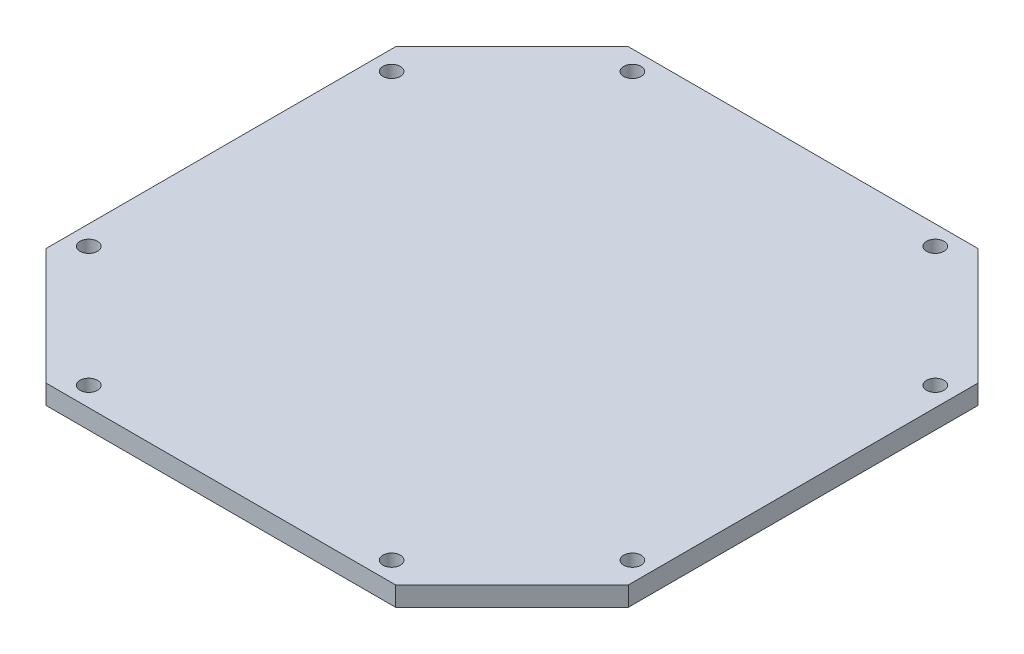
ISO-10303-21;
HEADER;
FILE_DESCRIPTION(('STEP AP214'),'2;1');
FILE_NAME('part.step','',(''),(''),'','','');
FILE_SCHEMA(('AUTOMOTIVE_DESIGN { 1 0 10303 214 1 1 1 1 }'));
ENDSEC;
DATA;
#1=APPLICATION_CONTEXT('core data for automotive mechanical design processes');
#2=APPLICATION_PROTOCOL_DEFINITION('international standard','automotive_design',2000,#1);
#3=PRODUCT_CONTEXT('',#1,'mechanical');
#4=PRODUCT('Part','Part','',(#3));
#5=PRODUCT_RELATED_PRODUCT_CATEGORY('part','',(#4));
#6=PRODUCT_DEFINITION_FORMATION('','',#4);
#7=PRODUCT_DEFINITION_CONTEXT('part definition',#1,'design');
#8=PRODUCT_DEFINITION('design','',#6,#7);
#9=PRODUCT_DEFINITION_SHAPE('','',#8);
#10=(LENGTH_UNIT() NAMED_UNIT(*) SI_UNIT(.MILLI.,.METRE.));
#11=(NAMED_UNIT(*) PLANE_ANGLE_UNIT() SI_UNIT($,.RADIAN.));
#12=(NAMED_UNIT(*) SI_UNIT($,.STERADIAN.) SOLID_ANGLE_UNIT());
#13=UNCERTAINTY_MEASURE_WITH_UNIT(LENGTH_MEASURE(1.E-05),#10,'distance_accuracy_value','');
#14=(GEOMETRIC_REPRESENTATION_CONTEXT(3) GLOBAL_UNCERTAINTY_ASSIGNED_CONTEXT((#13)) GLOBAL_UNIT_ASSIGNED_CONTEXT((#10,
#11,#12)) REPRESENTATION_CONTEXT('',''));
#15=CARTESIAN_POINT('',(0.,0.,0.));
#16=DIRECTION('',(0.,0.,1.));
#17=DIRECTION('',(1.,0.,0.));
#18=AXIS2_PLACEMENT_3D('',#15,#16,#17);
#19=CARTESIAN_POINT('',(150.,10.,0.));
#20=DIRECTION('',(-1.,0.,0.));
#21=DIRECTION('',(0.,0.,1.));
#22=AXIS2_PLACEMENT_3D('',#19,#20,#21);
#23=PLANE('',#22);
#24=DIRECTION('',(0.,0.,-1.));
#25=VECTOR('',#24,1.);
#26=CARTESIAN_POINT('',(150.,0.,0.));
#27=LINE('',#26,#25);
#28=CARTESIAN_POINT('',(150.,0.,90.));
#29=VERTEX_POINT('',#28);
#30=CARTESIAN_POINT('',(150.,0.,-90.));
#31=VERTEX_POINT('',#30);
#32=EDGE_CURVE('E144',#29,#31,#27,.T.);
#33=ORIENTED_EDGE('',*,*,#32,.T.);
#34=DIRECTION('',(0.,-1.,0.));
#35=VECTOR('',#34,1.);
#36=CARTESIAN_POINT('',(150.,10.,-90.));
#37=LINE('',#36,#35);
#38=CARTESIAN_POINT('',(150.,10.,-90.));
#39=VERTEX_POINT('',#38);
#40=EDGE_CURVE('E11',#39,#31,#37,.T.);
#41=ORIENTED_EDGE('',*,*,#40,.F.);
#42=DIRECTION('',(0.,0.,-1.));
#43=VECTOR('',#42,1.);
#44=CARTESIAN_POINT('',(150.,10.,0.));
#45=LINE('',#44,#43);
#46=CARTESIAN_POINT('',(150.,10.,90.));
#47=VERTEX_POINT('',#46);
#48=EDGE_CURVE('E170',#47,#39,#45,.T.);
#49=ORIENTED_EDGE('',*,*,#48,.F.);
#50=DIRECTION('',(0.,-1.,0.));
#51=VECTOR('',#50,1.);
#52=CARTESIAN_POINT('',(150.,10.,90.));
#53=LINE('',#52,#51);
#54=EDGE_CURVE('E140',#47,#29,#53,.T.);
#55=ORIENTED_EDGE('',*,*,#54,.T.);
#56=EDGE_LOOP('',(#33,#41,#49,#55));
#57=FACE_BOUND('',#56,.T.);
#58=ADVANCED_FACE('F45',(#57),#23,.F.);
#59=CARTESIAN_POINT('',(120.,10.,-120.));
#60=DIRECTION('',(-0.707106781186548,0.,0.707106781186547));
#61=DIRECTION('',(0.707106781186547,0.,0.707106781186548));
#62=AXIS2_PLACEMENT_3D('',#59,#60,#61);
#63=PLANE('',#62);
#64=DIRECTION('',(-0.707106781186547,0.,-0.707106781186548));
#65=VECTOR('',#64,1.);
#66=CARTESIAN_POINT('',(120.,0.,-120.));
#67=LINE('',#66,#65);
#68=CARTESIAN_POINT('',(90.,0.,-150.));
#69=VERTEX_POINT('',#68);
#70=EDGE_CURVE('E148',#31,#69,#67,.T.);
#71=ORIENTED_EDGE('',*,*,#70,.T.);
#72=DIRECTION('',(0.,-1.,0.));
#73=VECTOR('',#72,1.);
#74=CARTESIAN_POINT('',(90.,10.,-150.));
#75=LINE('',#74,#73);
#76=CARTESIAN_POINT('',(90.,10.,-150.));
#77=VERTEX_POINT('',#76);
#78=EDGE_CURVE('E54',#77,#69,#75,.T.);
#79=ORIENTED_EDGE('',*,*,#78,.F.);
#80=DIRECTION('',(-0.707106781186547,0.,-0.707106781186548));
#81=VECTOR('',#80,1.);
#82=CARTESIAN_POINT('',(120.,10.,-120.));
#83=LINE('',#82,#81);
#84=EDGE_CURVE('E101',#39,#77,#83,.T.);
#85=ORIENTED_EDGE('',*,*,#84,.F.);
#86=ORIENTED_EDGE('',*,*,#40,.T.);
#87=EDGE_LOOP('',(#71,#79,#85,#86));
#88=FACE_BOUND('',#87,.T.);
#89=ADVANCED_FACE('F305',(#88),#63,.F.);
#90=CARTESIAN_POINT('',(0.,10.,-150.));
#91=DIRECTION('',(0.,0.,1.));
#92=DIRECTION('',(1.,0.,0.));
#93=AXIS2_PLACEMENT_3D('',#90,#91,#92);
#94=PLANE('',#93);
#95=DIRECTION('',(-1.,0.,0.));
#96=VECTOR('',#95,1.);
#97=CARTESIAN_POINT('',(0.,0.,-150.));
#98=LINE('',#97,#96);
#99=CARTESIAN_POINT('',(-90.,0.,-150.));
#100=VERTEX_POINT('',#99);
#101=EDGE_CURVE('E152',#69,#100,#98,.T.);
#102=ORIENTED_EDGE('',*,*,#101,.T.);
#103=DIRECTION('',(0.,-1.,0.));
#104=VECTOR('',#103,1.);
#105=CARTESIAN_POINT('',(-90.,10.,-150.));
#106=LINE('',#105,#104);
#107=CARTESIAN_POINT('',(-90.,10.,-150.));
#108=VERTEX_POINT('',#107);
#109=EDGE_CURVE('E180',#108,#100,#106,.T.);
#110=ORIENTED_EDGE('',*,*,#109,.F.);
#111=DIRECTION('',(-1.,0.,0.));
#112=VECTOR('',#111,1.);
#113=CARTESIAN_POINT('',(0.,10.,-150.));
#114=LINE('',#113,#112);
#115=EDGE_CURVE('E190',#77,#108,#114,.T.);
#116=ORIENTED_EDGE('',*,*,#115,.F.);
#117=ORIENTED_EDGE('',*,*,#78,.T.);
#118=EDGE_LOOP('',(#102,#110,#116,#117));
#119=FACE_BOUND('',#118,.T.);
#120=ADVANCED_FACE('F188',(#119),#94,.F.);
#121=CARTESIAN_POINT('',(-120.,10.,-120.));
#122=DIRECTION('',(0.707106781186548,0.,0.707106781186547));
#123=DIRECTION('',(0.707106781186547,0.,-0.707106781186548));
#124=AXIS2_PLACEMENT_3D('',#121,#122,#123);
#125=PLANE('',#124);
#126=DIRECTION('',(-0.707106781186547,0.,0.707106781186548));
#127=VECTOR('',#126,1.);
#128=CARTESIAN_POINT('',(-120.,0.,-120.));
#129=LINE('',#128,#127);
#130=CARTESIAN_POINT('',(-150.,0.,-90.));
#131=VERTEX_POINT('',#130);
#132=EDGE_CURVE('E155',#100,#131,#129,.T.);
#133=ORIENTED_EDGE('',*,*,#132,.T.);
#134=DIRECTION('',(0.,-1.,0.));
#135=VECTOR('',#134,1.);
#136=CARTESIAN_POINT('',(-150.,10.,-90.));
#137=LINE('',#136,#135);
#138=CARTESIAN_POINT('',(-150.,10.,-90.));
#139=VERTEX_POINT('',#138);
#140=EDGE_CURVE('E177',#139,#131,#137,.T.);
#141=ORIENTED_EDGE('',*,*,#140,.F.);
#142=DIRECTION('',(-0.707106781186547,0.,0.707106781186548));
#143=VECTOR('',#142,1.);
#144=CARTESIAN_POINT('',(-120.,10.,-120.));
#145=LINE('',#144,#143);
#146=EDGE_CURVE('E200',#108,#139,#145,.T.);
#147=ORIENTED_EDGE('',*,*,#146,.F.);
#148=ORIENTED_EDGE('',*,*,#109,.T.);
#149=EDGE_LOOP('',(#133,#141,#147,#148));
#150=FACE_BOUND('',#149,.T.);
#151=ADVANCED_FACE('F198',(#150),#125,.F.);
#152=CARTESIAN_POINT('',(-150.,10.,0.));
#153=DIRECTION('',(-1.,0.,0.));
#154=DIRECTION('',(0.,0.,1.));
#155=AXIS2_PLACEMENT_3D('',#152,#153,#154);
#156=PLANE('',#155);
#157=DIRECTION('',(0.,0.,-1.));
#158=VECTOR('',#157,1.);
#159=CARTESIAN_POINT('',(-150.,0.,0.));
#160=LINE('',#159,#158);
#161=CARTESIAN_POINT('',(-150.,0.,90.));
#162=VERTEX_POINT('',#161);
#163=EDGE_CURVE('E159',#162,#131,#160,.T.);
#164=ORIENTED_EDGE('',*,*,#163,.F.);
#165=DIRECTION('',(0.,-1.,0.));
#166=VECTOR('',#165,1.);
#167=CARTESIAN_POINT('',(-150.,10.,90.));
#168=LINE('',#167,#166);
#169=CARTESIAN_POINT('',(-150.,10.,90.));
#170=VERTEX_POINT('',#169);
#171=EDGE_CURVE('E134',#170,#162,#168,.T.);
#172=ORIENTED_EDGE('',*,*,#171,.F.);
#173=DIRECTION('',(0.,0.,-1.));
#174=VECTOR('',#173,1.);
#175=CARTESIAN_POINT('',(-150.,10.,0.));
#176=LINE('',#175,#174);
#177=EDGE_CURVE('E121',#170,#139,#176,.T.);
#178=ORIENTED_EDGE('',*,*,#177,.T.);
#179=ORIENTED_EDGE('',*,*,#140,.T.);
#180=EDGE_LOOP('',(#164,#172,#178,#179));
#181=FACE_BOUND('',#180,.T.);
#182=ADVANCED_FACE('F313',(#181),#156,.T.);
#183=CARTESIAN_POINT('',(-120.,10.,120.));
#184=DIRECTION('',(0.707106781186548,0.,-0.707106781186547));
#185=DIRECTION('',(-0.707106781186547,0.,-0.707106781186548));
#186=AXIS2_PLACEMENT_3D('',#183,#184,#185);
#187=PLANE('',#186);
#188=DIRECTION('',(0.707106781186547,0.,0.707106781186548));
#189=VECTOR('',#188,1.);
#190=CARTESIAN_POINT('',(-120.,0.,120.));
#191=LINE('',#190,#189);
#192=CARTESIAN_POINT('',(-90.,0.,150.));
#193=VERTEX_POINT('',#192);
#194=EDGE_CURVE('E129',#162,#193,#191,.T.);
#195=ORIENTED_EDGE('',*,*,#194,.T.);
#196=DIRECTION('',(0.,-1.,0.));
#197=VECTOR('',#196,1.);
#198=CARTESIAN_POINT('',(-90.,10.,150.));
#199=LINE('',#198,#197);
#200=CARTESIAN_POINT('',(-90.,10.,150.));
#201=VERTEX_POINT('',#200);
#202=EDGE_CURVE('E126',#201,#193,#199,.T.);
#203=ORIENTED_EDGE('',*,*,#202,.F.);
#204=DIRECTION('',(0.707106781186547,0.,0.707106781186548));
#205=VECTOR('',#204,1.);
#206=CARTESIAN_POINT('',(-120.,10.,120.));
#207=LINE('',#206,#205);
#208=EDGE_CURVE('E115',#170,#201,#207,.T.);
#209=ORIENTED_EDGE('',*,*,#208,.F.);
#210=ORIENTED_EDGE('',*,*,#171,.T.);
#211=EDGE_LOOP('',(#195,#203,#209,#210));
#212=FACE_BOUND('',#211,.T.);
#213=ADVANCED_FACE('F127',(#212),#187,.F.);
#214=CARTESIAN_POINT('',(0.,10.,150.));
#215=DIRECTION('',(0.,0.,1.));
#216=DIRECTION('',(1.,0.,0.));
#217=AXIS2_PLACEMENT_3D('',#214,#215,#216);
#218=PLANE('',#217);
#219=DIRECTION('',(-1.,0.,0.));
#220=VECTOR('',#219,1.);
#221=CARTESIAN_POINT('',(0.,0.,150.));
#222=LINE('',#221,#220);
#223=CARTESIAN_POINT('',(90.,0.,150.));
#224=VERTEX_POINT('',#223);
#225=EDGE_CURVE('E165',#224,#193,#222,.T.);
#226=ORIENTED_EDGE('',*,*,#225,.F.);
#227=DIRECTION('',(0.,-1.,0.));
#228=VECTOR('',#227,1.);
#229=CARTESIAN_POINT('',(90.,10.,150.));
#230=LINE('',#229,#228);
#231=CARTESIAN_POINT('',(90.,10.,150.));
#232=VERTEX_POINT('',#231);
#233=EDGE_CURVE('E90',#232,#224,#230,.T.);
#234=ORIENTED_EDGE('',*,*,#233,.F.);
#235=DIRECTION('',(-1.,0.,0.));
#236=VECTOR('',#235,1.);
#237=CARTESIAN_POINT('',(0.,10.,150.));
#238=LINE('',#237,#236);
#239=EDGE_CURVE('E119',#232,#201,#238,.T.);
#240=ORIENTED_EDGE('',*,*,#239,.T.);
#241=ORIENTED_EDGE('',*,*,#202,.T.);
#242=EDGE_LOOP('',(#226,#234,#240,#241));
#243=FACE_BOUND('',#242,.T.);
#244=ADVANCED_FACE('F136',(#243),#218,.T.);
#245=CARTESIAN_POINT('',(120.,10.,120.));
#246=DIRECTION('',(-0.707106781186548,0.,-0.707106781186547));
#247=DIRECTION('',(-0.707106781186547,0.,0.707106781186548));
#248=AXIS2_PLACEMENT_3D('',#245,#246,#247);
#249=PLANE('',#248);
#250=DIRECTION('',(0.707106781186547,0.,-0.707106781186548));
#251=VECTOR('',#250,1.);
#252=CARTESIAN_POINT('',(120.,0.,120.));
#253=LINE('',#252,#251);
#254=EDGE_CURVE('E93',#224,#29,#253,.T.);
#255=ORIENTED_EDGE('',*,*,#254,.T.);
#256=ORIENTED_EDGE('',*,*,#54,.F.);
#257=DIRECTION('',(0.707106781186547,0.,-0.707106781186548));
#258=VECTOR('',#257,1.);
#259=CARTESIAN_POINT('',(120.,10.,120.));
#260=LINE('',#259,#258);
#261=EDGE_CURVE('E62',#232,#47,#260,.T.);
#262=ORIENTED_EDGE('',*,*,#261,.F.);
#263=ORIENTED_EDGE('',*,*,#233,.T.);
#264=EDGE_LOOP('',(#255,#256,#262,#263));
#265=FACE_BOUND('',#264,.T.);
#266=ADVANCED_FACE('F279',(#265),#249,.F.);
#267=CARTESIAN_POINT('',(0.,10.,0.));
#268=DIRECTION('',(0.,1.,0.));
#269=DIRECTION('',(0.,0.,1.));
#270=AXIS2_PLACEMENT_3D('',#267,#268,#269);
#271=PLANE('',#270);
#272=CARTESIAN_POINT('',(-140.,10.,78.));
#273=DIRECTION('',(0.,1.,0.));
#274=DIRECTION('',(0.,0.,1.));
#275=AXIS2_PLACEMENT_3D('',#272,#273,#274);
#276=CIRCLE('',#275,4.49999999999999);
#277=CARTESIAN_POINT('',(-140.,10.,82.5));
#278=VERTEX_POINT('',#277);
#279=EDGE_CURVE('E215',#278,#278,#276,.T.);
#280=ORIENTED_EDGE('',*,*,#279,.F.);
#281=EDGE_LOOP('',(#280));
#282=FACE_BOUND('',#281,.T.);
#283=CARTESIAN_POINT('',(-140.,10.,-78.));
#284=DIRECTION('',(0.,1.,0.));
#285=DIRECTION('',(0.,0.,1.));
#286=AXIS2_PLACEMENT_3D('',#283,#284,#285);
#287=CIRCLE('',#286,4.49999999999999);
#288=CARTESIAN_POINT('',(-140.,10.,-73.5));
#289=VERTEX_POINT('',#288);
#290=EDGE_CURVE('E240',#289,#289,#287,.T.);
#291=ORIENTED_EDGE('',*,*,#290,.F.);
#292=EDGE_LOOP('',(#291));
#293=FACE_BOUND('',#292,.T.);
#294=CARTESIAN_POINT('',(-78.,10.,140.));
#295=DIRECTION('',(0.,1.,0.));
#296=DIRECTION('',(0.,0.,1.));
#297=AXIS2_PLACEMENT_3D('',#294,#295,#296);
#298=CIRCLE('',#297,4.50000000000001);
#299=CARTESIAN_POINT('',(-78.,10.,144.5));
#300=VERTEX_POINT('',#299);
#301=EDGE_CURVE('E232',#300,#300,#298,.T.);
#302=ORIENTED_EDGE('',*,*,#301,.F.);
#303=EDGE_LOOP('',(#302));
#304=FACE_BOUND('',#303,.T.);
#305=CARTESIAN_POINT('',(78.,10.,140.));
#306=DIRECTION('',(0.,1.,0.));
#307=DIRECTION('',(0.,0.,1.));
#308=AXIS2_PLACEMENT_3D('',#305,#306,#307);
#309=CIRCLE('',#308,4.50000000000001);
#310=CARTESIAN_POINT('',(78.,10.,144.5));
#311=VERTEX_POINT('',#310);
#312=EDGE_CURVE('E223',#311,#311,#309,.T.);
#313=ORIENTED_EDGE('',*,*,#312,.F.);
#314=EDGE_LOOP('',(#313));
#315=FACE_BOUND('',#314,.T.);
#316=CARTESIAN_POINT('',(140.,10.,78.));
#317=DIRECTION('',(0.,1.,0.));
#318=DIRECTION('',(0.,0.,1.));
#319=AXIS2_PLACEMENT_3D('',#316,#317,#318);
#320=CIRCLE('',#319,4.49999999999999);
#321=CARTESIAN_POINT('',(140.,10.,82.5));
#322=VERTEX_POINT('',#321);
#323=EDGE_CURVE('E224',#322,#322,#320,.T.);
#324=ORIENTED_EDGE('',*,*,#323,.F.);
#325=EDGE_LOOP('',(#324));
#326=FACE_BOUND('',#325,.T.);
#327=CARTESIAN_POINT('',(140.,10.,-78.));
#328=DIRECTION('',(0.,1.,0.));
#329=DIRECTION('',(0.,0.,1.));
#330=AXIS2_PLACEMENT_3D('',#327,#328,#329);
#331=CIRCLE('',#330,4.49999999999999);
#332=CARTESIAN_POINT('',(140.,10.,-73.5));
#333=VERTEX_POINT('',#332);
#334=EDGE_CURVE('E263',#333,#333,#331,.T.);
#335=ORIENTED_EDGE('',*,*,#334,.F.);
#336=EDGE_LOOP('',(#335));
#337=FACE_BOUND('',#336,.T.);
#338=CARTESIAN_POINT('',(78.,10.,-140.));
#339=DIRECTION('',(0.,1.,0.));
#340=DIRECTION('',(0.,0.,1.));
#341=AXIS2_PLACEMENT_3D('',#338,#339,#340);
#342=CIRCLE('',#341,4.50000000000001);
#343=CARTESIAN_POINT('',(78.,10.,-135.5));
#344=VERTEX_POINT('',#343);
#345=EDGE_CURVE('E255',#344,#344,#342,.T.);
#346=ORIENTED_EDGE('',*,*,#345,.F.);
#347=EDGE_LOOP('',(#346));
#348=FACE_BOUND('',#347,.T.);
#349=CARTESIAN_POINT('',(-78.,10.,-140.));
#350=DIRECTION('',(0.,1.,0.));
#351=DIRECTION('',(0.,0.,1.));
#352=AXIS2_PLACEMENT_3D('',#349,#350,#351);
#353=CIRCLE('',#352,4.50000000000001);
#354=CARTESIAN_POINT('',(-78.,10.,-135.5));
#355=VERTEX_POINT('',#354);
#356=EDGE_CURVE('E211',#355,#355,#353,.T.);
#357=ORIENTED_EDGE('',*,*,#356,.F.);
#358=EDGE_LOOP('',(#357));
#359=FACE_BOUND('',#358,.T.);
#360=ORIENTED_EDGE('',*,*,#48,.T.);
#361=ORIENTED_EDGE('',*,*,#84,.T.);
#362=ORIENTED_EDGE('',*,*,#115,.T.);
#363=ORIENTED_EDGE('',*,*,#146,.T.);
#364=ORIENTED_EDGE('',*,*,#177,.F.);
#365=ORIENTED_EDGE('',*,*,#208,.T.);
#366=ORIENTED_EDGE('',*,*,#239,.F.);
#367=ORIENTED_EDGE('',*,*,#261,.T.);
#368=EDGE_LOOP('',(#360,#361,#362,#363,#364,#365,#366,#367));
#369=FACE_BOUND('',#368,.T.);
#370=ADVANCED_FACE('F117',(#282,#293,#304,#315,#326,#337,#348,#359,#369),#271,.T.);
#371=CARTESIAN_POINT('',(0.,0.,0.));
#372=DIRECTION('',(0.,1.,0.));
#373=DIRECTION('',(0.,0.,1.));
#374=AXIS2_PLACEMENT_3D('',#371,#372,#373);
#375=PLANE('',#374);
#376=CARTESIAN_POINT('',(-140.,0.,78.));
#377=DIRECTION('',(0.,1.,0.));
#378=DIRECTION('',(0.,0.,1.));
#379=AXIS2_PLACEMENT_3D('',#376,#377,#378);
#380=CIRCLE('',#379,4.49999999999999);
#381=CARTESIAN_POINT('',(-140.,0.,82.5));
#382=VERTEX_POINT('',#381);
#383=EDGE_CURVE('E244',#382,#382,#380,.T.);
#384=ORIENTED_EDGE('',*,*,#383,.T.);
#385=EDGE_LOOP('',(#384));
#386=FACE_BOUND('',#385,.T.);
#387=CARTESIAN_POINT('',(-140.,0.,-78.));
#388=DIRECTION('',(0.,1.,0.));
#389=DIRECTION('',(0.,0.,1.));
#390=AXIS2_PLACEMENT_3D('',#387,#388,#389);
#391=CIRCLE('',#390,4.49999999999999);
#392=CARTESIAN_POINT('',(-140.,0.,-73.5));
#393=VERTEX_POINT('',#392);
#394=EDGE_CURVE('E236',#393,#393,#391,.T.);
#395=ORIENTED_EDGE('',*,*,#394,.T.);
#396=EDGE_LOOP('',(#395));
#397=FACE_BOUND('',#396,.T.);
#398=CARTESIAN_POINT('',(-78.,0.,140.));
#399=DIRECTION('',(0.,1.,0.));
#400=DIRECTION('',(0.,0.,1.));
#401=AXIS2_PLACEMENT_3D('',#398,#399,#400);
#402=CIRCLE('',#401,4.50000000000001);
#403=CARTESIAN_POINT('',(-78.,0.,144.5));
#404=VERTEX_POINT('',#403);
#405=EDGE_CURVE('E228',#404,#404,#402,.T.);
#406=ORIENTED_EDGE('',*,*,#405,.T.);
#407=EDGE_LOOP('',(#406));
#408=FACE_BOUND('',#407,.T.);
#409=CARTESIAN_POINT('',(78.,0.,140.));
#410=DIRECTION('',(0.,1.,0.));
#411=DIRECTION('',(0.,0.,1.));
#412=AXIS2_PLACEMENT_3D('',#409,#410,#411);
#413=CIRCLE('',#412,4.50000000000001);
#414=CARTESIAN_POINT('',(78.,0.,144.5));
#415=VERTEX_POINT('',#414);
#416=EDGE_CURVE('E219',#415,#415,#413,.T.);
#417=ORIENTED_EDGE('',*,*,#416,.T.);
#418=EDGE_LOOP('',(#417));
#419=FACE_BOUND('',#418,.T.);
#420=CARTESIAN_POINT('',(140.,0.,78.));
#421=DIRECTION('',(0.,1.,0.));
#422=DIRECTION('',(0.,0.,1.));
#423=AXIS2_PLACEMENT_3D('',#420,#421,#422);
#424=CIRCLE('',#423,4.49999999999999);
#425=CARTESIAN_POINT('',(140.,0.,82.5));
#426=VERTEX_POINT('',#425);
#427=EDGE_CURVE('E267',#426,#426,#424,.T.);
#428=ORIENTED_EDGE('',*,*,#427,.T.);
#429=EDGE_LOOP('',(#428));
#430=FACE_BOUND('',#429,.T.);
#431=CARTESIAN_POINT('',(140.,0.,-78.));
#432=DIRECTION('',(0.,1.,0.));
#433=DIRECTION('',(0.,0.,1.));
#434=AXIS2_PLACEMENT_3D('',#431,#432,#433);
#435=CIRCLE('',#434,4.49999999999999);
#436=CARTESIAN_POINT('',(140.,0.,-73.5));
#437=VERTEX_POINT('',#436);
#438=EDGE_CURVE('E259',#437,#437,#435,.T.);
#439=ORIENTED_EDGE('',*,*,#438,.T.);
#440=EDGE_LOOP('',(#439));
#441=FACE_BOUND('',#440,.T.);
#442=CARTESIAN_POINT('',(78.,0.,-140.));
#443=DIRECTION('',(0.,1.,0.));
#444=DIRECTION('',(0.,0.,1.));
#445=AXIS2_PLACEMENT_3D('',#442,#443,#444);
#446=CIRCLE('',#445,4.50000000000001);
#447=CARTESIAN_POINT('',(78.,0.,-135.5));
#448=VERTEX_POINT('',#447);
#449=EDGE_CURVE('E251',#448,#448,#446,.T.);
#450=ORIENTED_EDGE('',*,*,#449,.T.);
#451=EDGE_LOOP('',(#450));
#452=FACE_BOUND('',#451,.T.);
#453=CARTESIAN_POINT('',(-78.,0.,-140.));
#454=DIRECTION('',(0.,1.,0.));
#455=DIRECTION('',(0.,0.,1.));
#456=AXIS2_PLACEMENT_3D('',#453,#454,#455);
#457=CIRCLE('',#456,4.50000000000001);
#458=CARTESIAN_POINT('',(-78.,0.,-135.5));
#459=VERTEX_POINT('',#458);
#460=EDGE_CURVE('E149',#459,#459,#457,.T.);
#461=ORIENTED_EDGE('',*,*,#460,.T.);
#462=EDGE_LOOP('',(#461));
#463=FACE_BOUND('',#462,.T.);
#464=ORIENTED_EDGE('',*,*,#32,.F.);
#465=ORIENTED_EDGE('',*,*,#254,.F.);
#466=ORIENTED_EDGE('',*,*,#225,.T.);
#467=ORIENTED_EDGE('',*,*,#194,.F.);
#468=ORIENTED_EDGE('',*,*,#163,.T.);
#469=ORIENTED_EDGE('',*,*,#132,.F.);
#470=ORIENTED_EDGE('',*,*,#101,.F.);
#471=ORIENTED_EDGE('',*,*,#70,.F.);
#472=EDGE_LOOP('',(#464,#465,#466,#467,#468,#469,#470,#471));
#473=FACE_BOUND('',#472,.T.);
#474=ADVANCED_FACE('F194',(#386,#397,#408,#419,#430,#441,#452,#463,#473),#375,.F.);
#475=CARTESIAN_POINT('',(-78.,0.,-140.));
#476=DIRECTION('',(0.,1.,0.));
#477=DIRECTION('',(0.,0.,1.));
#478=AXIS2_PLACEMENT_3D('',#475,#476,#477);
#479=CYLINDRICAL_SURFACE('',#478,4.50000000000001);
#480=ORIENTED_EDGE('',*,*,#460,.F.);
#481=EDGE_LOOP('',(#480));
#482=FACE_BOUND('',#481,.T.);
#483=ORIENTED_EDGE('',*,*,#356,.T.);
#484=EDGE_LOOP('',(#483));
#485=FACE_BOUND('',#484,.T.);
#486=ADVANCED_FACE('F288',(#482,#485),#479,.F.);
#487=CARTESIAN_POINT('',(78.,0.,-140.));
#488=DIRECTION('',(0.,1.,0.));
#489=DIRECTION('',(0.,0.,1.));
#490=AXIS2_PLACEMENT_3D('',#487,#488,#489);
#491=CYLINDRICAL_SURFACE('',#490,4.50000000000001);
#492=ORIENTED_EDGE('',*,*,#449,.F.);
#493=EDGE_LOOP('',(#492));
#494=FACE_BOUND('',#493,.T.);
#495=ORIENTED_EDGE('',*,*,#345,.T.);
#496=EDGE_LOOP('',(#495));
#497=FACE_BOUND('',#496,.T.);
#498=ADVANCED_FACE('F290',(#494,#497),#491,.F.);
#499=CARTESIAN_POINT('',(140.,0.,-78.));
#500=DIRECTION('',(0.,1.,0.));
#501=DIRECTION('',(0.,0.,1.));
#502=AXIS2_PLACEMENT_3D('',#499,#500,#501);
#503=CYLINDRICAL_SURFACE('',#502,4.49999999999999);
#504=ORIENTED_EDGE('',*,*,#438,.F.);
#505=EDGE_LOOP('',(#504));
#506=FACE_BOUND('',#505,.T.);
#507=ORIENTED_EDGE('',*,*,#334,.T.);
#508=EDGE_LOOP('',(#507));
#509=FACE_BOUND('',#508,.T.);
#510=ADVANCED_FACE('F297',(#506,#509),#503,.F.);
#511=CARTESIAN_POINT('',(140.,0.,78.));
#512=DIRECTION('',(0.,1.,0.));
#513=DIRECTION('',(0.,0.,1.));
#514=AXIS2_PLACEMENT_3D('',#511,#512,#513);
#515=CYLINDRICAL_SURFACE('',#514,4.49999999999999);
#516=ORIENTED_EDGE('',*,*,#427,.F.);
#517=EDGE_LOOP('',(#516));
#518=FACE_BOUND('',#517,.T.);
#519=ORIENTED_EDGE('',*,*,#323,.T.);
#520=EDGE_LOOP('',(#519));
#521=FACE_BOUND('',#520,.T.);
#522=ADVANCED_FACE('F275',(#518,#521),#515,.F.);
#523=CARTESIAN_POINT('',(78.,0.,140.));
#524=DIRECTION('',(0.,1.,0.));
#525=DIRECTION('',(0.,0.,1.));
#526=AXIS2_PLACEMENT_3D('',#523,#524,#525);
#527=CYLINDRICAL_SURFACE('',#526,4.50000000000001);
#528=ORIENTED_EDGE('',*,*,#416,.F.);
#529=EDGE_LOOP('',(#528));
#530=FACE_BOUND('',#529,.T.);
#531=ORIENTED_EDGE('',*,*,#312,.T.);
#532=EDGE_LOOP('',(#531));
#533=FACE_BOUND('',#532,.T.);
#534=ADVANCED_FACE('F410',(#530,#533),#527,.F.);
#535=CARTESIAN_POINT('',(-78.,0.,140.));
#536=DIRECTION('',(0.,1.,0.));
#537=DIRECTION('',(0.,0.,1.));
#538=AXIS2_PLACEMENT_3D('',#535,#536,#537);
#539=CYLINDRICAL_SURFACE('',#538,4.50000000000001);
#540=ORIENTED_EDGE('',*,*,#405,.F.);
#541=EDGE_LOOP('',(#540));
#542=FACE_BOUND('',#541,.T.);
#543=ORIENTED_EDGE('',*,*,#301,.T.);
#544=EDGE_LOOP('',(#543));
#545=FACE_BOUND('',#544,.T.);
#546=ADVANCED_FACE('F421',(#542,#545),#539,.F.);
#547=CARTESIAN_POINT('',(-140.,0.,-78.));
#548=DIRECTION('',(0.,1.,0.));
#549=DIRECTION('',(0.,0.,1.));
#550=AXIS2_PLACEMENT_3D('',#547,#548,#549);
#551=CYLINDRICAL_SURFACE('',#550,4.49999999999999);
#552=ORIENTED_EDGE('',*,*,#394,.F.);
#553=EDGE_LOOP('',(#552));
#554=FACE_BOUND('',#553,.T.);
#555=ORIENTED_EDGE('',*,*,#290,.T.);
#556=EDGE_LOOP('',(#555));
#557=FACE_BOUND('',#556,.T.);
#558=ADVANCED_FACE('F431',(#554,#557),#551,.F.);
#559=CARTESIAN_POINT('',(-140.,0.,78.));
#560=DIRECTION('',(0.,1.,0.));
#561=DIRECTION('',(0.,0.,1.));
#562=AXIS2_PLACEMENT_3D('',#559,#560,#561);
#563=CYLINDRICAL_SURFACE('',#562,4.49999999999999);
#564=ORIENTED_EDGE('',*,*,#383,.F.);
#565=EDGE_LOOP('',(#564));
#566=FACE_BOUND('',#565,.T.);
#567=ORIENTED_EDGE('',*,*,#279,.T.);
#568=EDGE_LOOP('',(#567));
#569=FACE_BOUND('',#568,.T.);
#570=ADVANCED_FACE('F442',(#566,#569),#563,.F.);
#571=CLOSED_SHELL('',(#58,#89,#120,#151,#182,#213,#244,#266,#370,#474,#486,#498,#510,#522,#534,
#546,#558,#570));
#572=MANIFOLD_SOLID_BREP('B2',#571);
#573=ADVANCED_BREP_SHAPE_REPRESENTATION('',(#18,#572),#14);
#574=SHAPE_DEFINITION_REPRESENTATION(#9,#573);
ENDSEC;
END-ISO-10303-21;
